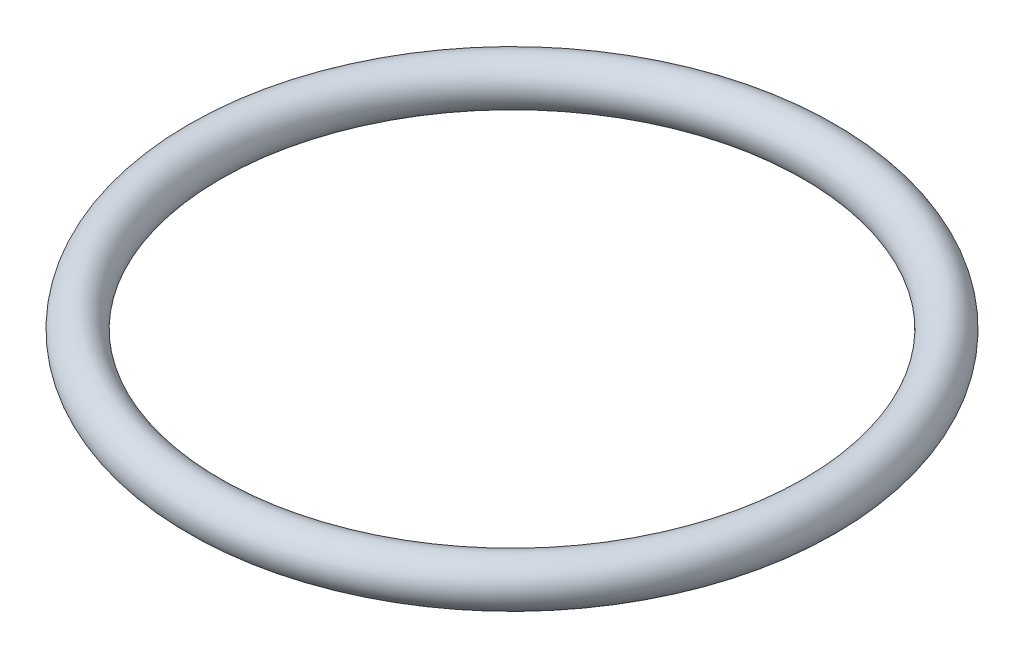
ISO-10303-21;
HEADER;
FILE_DESCRIPTION(('STEP AP214'),'2;1');
FILE_NAME('part.step','',(''),(''),'','','');
FILE_SCHEMA(('AUTOMOTIVE_DESIGN { 1 0 10303 214 1 1 1 1 }'));
ENDSEC;
DATA;
#1=APPLICATION_CONTEXT('core data for automotive mechanical design processes');
#2=APPLICATION_PROTOCOL_DEFINITION('international standard','automotive_design',2000,#1);
#3=PRODUCT_CONTEXT('',#1,'mechanical');
#4=PRODUCT('Part','Part','',(#3));
#5=PRODUCT_RELATED_PRODUCT_CATEGORY('part','',(#4));
#6=PRODUCT_DEFINITION_FORMATION('','',#4);
#7=PRODUCT_DEFINITION_CONTEXT('part definition',#1,'design');
#8=PRODUCT_DEFINITION('design','',#6,#7);
#9=PRODUCT_DEFINITION_SHAPE('','',#8);
#10=(LENGTH_UNIT() NAMED_UNIT(*) SI_UNIT(.MILLI.,.METRE.));
#11=(NAMED_UNIT(*) PLANE_ANGLE_UNIT() SI_UNIT($,.RADIAN.));
#12=(NAMED_UNIT(*) SI_UNIT($,.STERADIAN.) SOLID_ANGLE_UNIT());
#13=UNCERTAINTY_MEASURE_WITH_UNIT(LENGTH_MEASURE(1.E-05),#10,'distance_accuracy_value','');
#14=(GEOMETRIC_REPRESENTATION_CONTEXT(3) GLOBAL_UNCERTAINTY_ASSIGNED_CONTEXT((#13)) GLOBAL_UNIT_ASSIGNED_CONTEXT((#10,
#11,#12)) REPRESENTATION_CONTEXT('',''));
#15=CARTESIAN_POINT('',(0.,0.,0.));
#16=DIRECTION('',(0.,0.,1.));
#17=DIRECTION('',(1.,0.,0.));
#18=AXIS2_PLACEMENT_3D('',#15,#16,#17);
#19=CARTESIAN_POINT('',(0.,0.,0.));
#20=DIRECTION('',(0.,1.,0.));
#21=DIRECTION('',(1.,0.,0.));
#22=AXIS2_PLACEMENT_3D('',#19,#20,#21);
#23=TOROIDAL_SURFACE('',#22,13.75,1.);
#24=ADVANCED_FACE('F13',(),#23,.T.);
#25=CLOSED_SHELL('',(#24));
#26=MANIFOLD_SOLID_BREP('B1',#25);
#27=ADVANCED_BREP_SHAPE_REPRESENTATION('',(#18,#26),#14);
#28=SHAPE_DEFINITION_REPRESENTATION(#9,#27);
ENDSEC;
END-ISO-10303-21;
